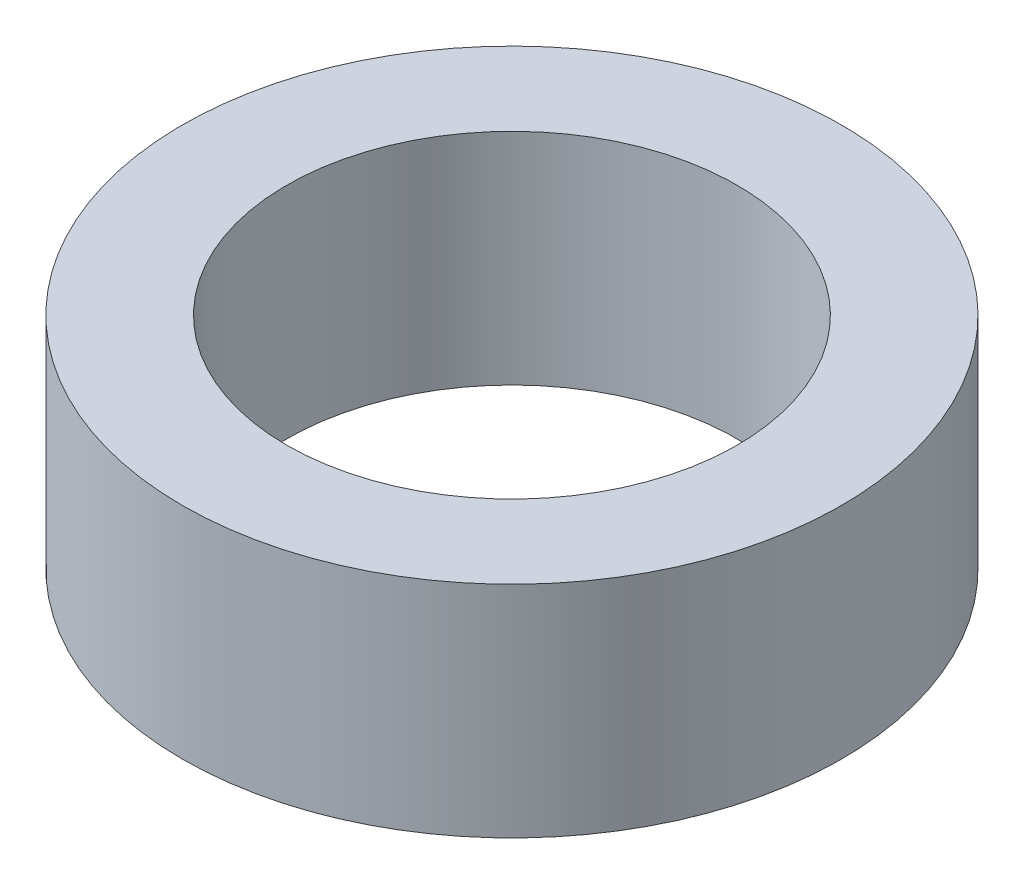
ISO-10303-21;
HEADER;
FILE_DESCRIPTION(('STEP AP214'),'2;1');
FILE_NAME('part.step','',(''),(''),'','','');
FILE_SCHEMA(('AUTOMOTIVE_DESIGN { 1 0 10303 214 1 1 1 1 }'));
ENDSEC;
DATA;
#1=APPLICATION_CONTEXT('core data for automotive mechanical design processes');
#2=APPLICATION_PROTOCOL_DEFINITION('international standard','automotive_design',2000,#1);
#3=PRODUCT_CONTEXT('',#1,'mechanical');
#4=PRODUCT('Part','Part','',(#3));
#5=PRODUCT_RELATED_PRODUCT_CATEGORY('part','',(#4));
#6=PRODUCT_DEFINITION_FORMATION('','',#4);
#7=PRODUCT_DEFINITION_CONTEXT('part definition',#1,'design');
#8=PRODUCT_DEFINITION('design','',#6,#7);
#9=PRODUCT_DEFINITION_SHAPE('','',#8);
#10=(LENGTH_UNIT() NAMED_UNIT(*) SI_UNIT(.MILLI.,.METRE.));
#11=(NAMED_UNIT(*) PLANE_ANGLE_UNIT() SI_UNIT($,.RADIAN.));
#12=(NAMED_UNIT(*) SI_UNIT($,.STERADIAN.) SOLID_ANGLE_UNIT());
#13=UNCERTAINTY_MEASURE_WITH_UNIT(LENGTH_MEASURE(1.E-05),#10,'distance_accuracy_value','');
#14=(GEOMETRIC_REPRESENTATION_CONTEXT(3) GLOBAL_UNCERTAINTY_ASSIGNED_CONTEXT((#13)) GLOBAL_UNIT_ASSIGNED_CONTEXT((#10,
#11,#12)) REPRESENTATION_CONTEXT('',''));
#15=CARTESIAN_POINT('',(0.,0.,0.));
#16=DIRECTION('',(0.,0.,1.));
#17=DIRECTION('',(1.,0.,0.));
#18=AXIS2_PLACEMENT_3D('',#15,#16,#17);
#19=CARTESIAN_POINT('',(0.,2.,0.));
#20=DIRECTION('',(0.,1.,0.));
#21=DIRECTION('',(0.,0.,1.));
#22=AXIS2_PLACEMENT_3D('',#19,#20,#21);
#23=PLANE('',#22);
#24=CARTESIAN_POINT('',(0.,2.,0.));
#25=DIRECTION('',(0.,1.,0.));
#26=DIRECTION('',(0.,0.,1.));
#27=AXIS2_PLACEMENT_3D('',#24,#25,#26);
#28=CIRCLE('',#27,3.);
#29=CARTESIAN_POINT('',(0.,2.,3.));
#30=VERTEX_POINT('',#29);
#31=EDGE_CURVE('E10',#30,#30,#28,.T.);
#32=ORIENTED_EDGE('',*,*,#31,.T.);
#33=EDGE_LOOP('',(#32));
#34=FACE_BOUND('',#33,.T.);
#35=CARTESIAN_POINT('',(0.,2.,0.));
#36=DIRECTION('',(0.,1.,0.));
#37=DIRECTION('',(0.,0.,1.));
#38=AXIS2_PLACEMENT_3D('',#35,#36,#37);
#39=CIRCLE('',#38,2.05);
#40=CARTESIAN_POINT('',(0.,2.,2.05));
#41=VERTEX_POINT('',#40);
#42=EDGE_CURVE('E43',#41,#41,#39,.T.);
#43=ORIENTED_EDGE('',*,*,#42,.F.);
#44=EDGE_LOOP('',(#43));
#45=FACE_BOUND('',#44,.T.);
#46=ADVANCED_FACE('F32',(#34,#45),#23,.T.);
#47=CARTESIAN_POINT('',(0.,0.,0.));
#48=DIRECTION('',(0.,1.,0.));
#49=DIRECTION('',(0.,0.,1.));
#50=AXIS2_PLACEMENT_3D('',#47,#48,#49);
#51=PLANE('',#50);
#52=CARTESIAN_POINT('',(0.,0.,0.));
#53=DIRECTION('',(0.,1.,0.));
#54=DIRECTION('',(0.,0.,1.));
#55=AXIS2_PLACEMENT_3D('',#52,#53,#54);
#56=CIRCLE('',#55,3.);
#57=CARTESIAN_POINT('',(0.,0.,3.));
#58=VERTEX_POINT('',#57);
#59=EDGE_CURVE('E36',#58,#58,#56,.T.);
#60=ORIENTED_EDGE('',*,*,#59,.F.);
#61=EDGE_LOOP('',(#60));
#62=FACE_BOUND('',#61,.T.);
#63=CARTESIAN_POINT('',(0.,0.,0.));
#64=DIRECTION('',(0.,1.,0.));
#65=DIRECTION('',(0.,0.,1.));
#66=AXIS2_PLACEMENT_3D('',#63,#64,#65);
#67=CIRCLE('',#66,2.05);
#68=CARTESIAN_POINT('',(0.,0.,2.05));
#69=VERTEX_POINT('',#68);
#70=EDGE_CURVE('E45',#69,#69,#67,.T.);
#71=ORIENTED_EDGE('',*,*,#70,.T.);
#72=EDGE_LOOP('',(#71));
#73=FACE_BOUND('',#72,.T.);
#74=ADVANCED_FACE('F55',(#62,#73),#51,.F.);
#75=CARTESIAN_POINT('',(0.,2.,0.));
#76=DIRECTION('',(0.,-1.,0.));
#77=DIRECTION('',(0.,0.,-1.));
#78=AXIS2_PLACEMENT_3D('',#75,#76,#77);
#79=CYLINDRICAL_SURFACE('',#78,3.);
#80=ORIENTED_EDGE('',*,*,#31,.F.);
#81=EDGE_LOOP('',(#80));
#82=FACE_BOUND('',#81,.T.);
#83=ORIENTED_EDGE('',*,*,#59,.T.);
#84=EDGE_LOOP('',(#83));
#85=FACE_BOUND('',#84,.T.);
#86=ADVANCED_FACE('F34',(#82,#85),#79,.T.);
#87=CARTESIAN_POINT('',(0.,2.,0.));
#88=DIRECTION('',(0.,-1.,0.));
#89=DIRECTION('',(0.,0.,-1.));
#90=AXIS2_PLACEMENT_3D('',#87,#88,#89);
#91=CYLINDRICAL_SURFACE('',#90,2.05);
#92=ORIENTED_EDGE('',*,*,#42,.T.);
#93=EDGE_LOOP('',(#92));
#94=FACE_BOUND('',#93,.T.);
#95=ORIENTED_EDGE('',*,*,#70,.F.);
#96=EDGE_LOOP('',(#95));
#97=FACE_BOUND('',#96,.T.);
#98=ADVANCED_FACE('F51',(#94,#97),#91,.F.);
#99=CLOSED_SHELL('',(#46,#74,#86,#98));
#100=MANIFOLD_SOLID_BREP('B2',#99);
#101=ADVANCED_BREP_SHAPE_REPRESENTATION('',(#18,#100),#14);
#102=SHAPE_DEFINITION_REPRESENTATION(#9,#101);
ENDSEC;
END-ISO-10303-21;
